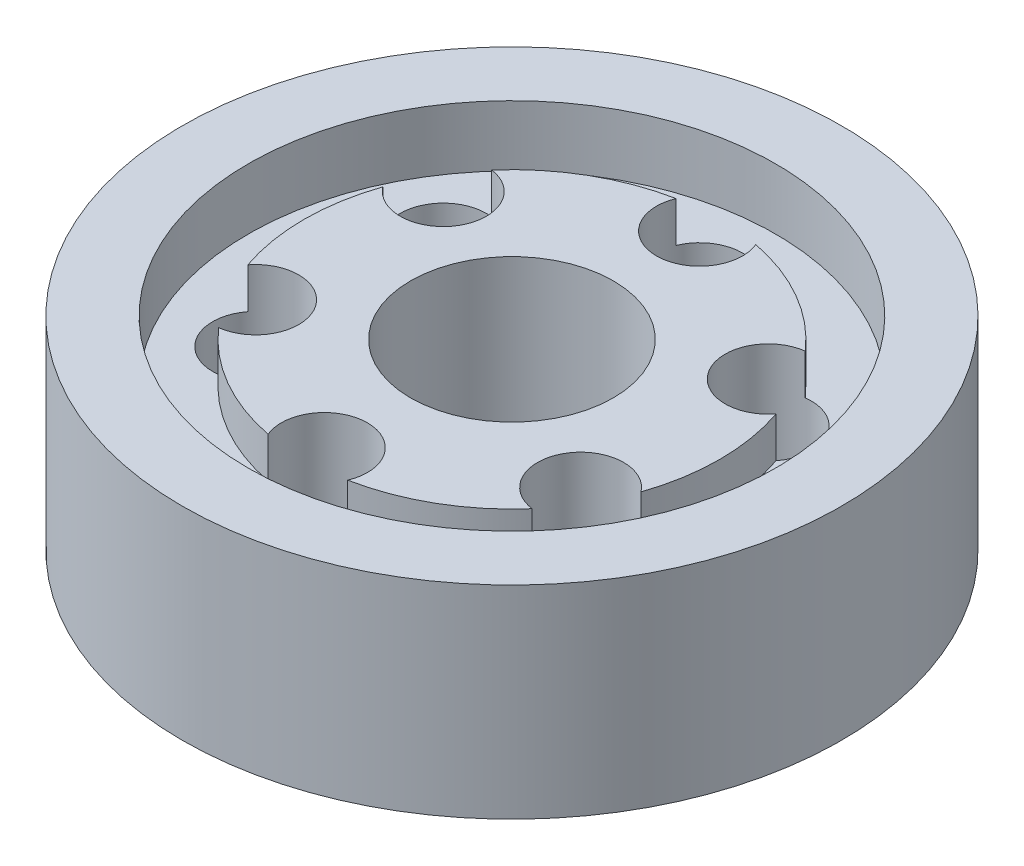
ISO-10303-21;
HEADER;
FILE_DESCRIPTION(('STEP AP214'),'2;1');
FILE_NAME('part.step','',(''),(''),'','','');
FILE_SCHEMA(('AUTOMOTIVE_DESIGN { 1 0 10303 214 1 1 1 1 }'));
ENDSEC;
DATA;
#1=APPLICATION_CONTEXT('core data for automotive mechanical design processes');
#2=APPLICATION_PROTOCOL_DEFINITION('international standard','automotive_design',2000,#1);
#3=PRODUCT_CONTEXT('',#1,'mechanical');
#4=PRODUCT('Part','Part','',(#3));
#5=PRODUCT_RELATED_PRODUCT_CATEGORY('part','',(#4));
#6=PRODUCT_DEFINITION_FORMATION('','',#4);
#7=PRODUCT_DEFINITION_CONTEXT('part definition',#1,'design');
#8=PRODUCT_DEFINITION('design','',#6,#7);
#9=PRODUCT_DEFINITION_SHAPE('','',#8);
#10=(LENGTH_UNIT() NAMED_UNIT(*) SI_UNIT(.MILLI.,.METRE.));
#11=(NAMED_UNIT(*) PLANE_ANGLE_UNIT() SI_UNIT($,.RADIAN.));
#12=(NAMED_UNIT(*) SI_UNIT($,.STERADIAN.) SOLID_ANGLE_UNIT());
#13=UNCERTAINTY_MEASURE_WITH_UNIT(LENGTH_MEASURE(1.E-05),#10,'distance_accuracy_value','');
#14=(GEOMETRIC_REPRESENTATION_CONTEXT(3) GLOBAL_UNCERTAINTY_ASSIGNED_CONTEXT((#13)) GLOBAL_UNIT_ASSIGNED_CONTEXT((#10,
#11,#12)) REPRESENTATION_CONTEXT('',''));
#15=CARTESIAN_POINT('',(0.,0.,0.));
#16=DIRECTION('',(0.,0.,1.));
#17=DIRECTION('',(1.,0.,0.));
#18=AXIS2_PLACEMENT_3D('',#15,#16,#17);
#19=CARTESIAN_POINT('',(0.,18.,0.));
#20=DIRECTION('',(0.,-1.,0.));
#21=DIRECTION('',(0.,0.,-1.));
#22=AXIS2_PLACEMENT_3D('',#19,#20,#21);
#23=CYLINDRICAL_SURFACE('',#22,20.5);
#24=CARTESIAN_POINT('',(0.,14.,0.));
#25=DIRECTION('',(0.,1.,0.));
#26=DIRECTION('',(0.,0.,1.));
#27=AXIS2_PLACEMENT_3D('',#24,#25,#26);
#28=CIRCLE('',#27,20.5);
#29=CARTESIAN_POINT('',(-19.3889539201822,14.,-6.65721156949742));
#30=VERTEX_POINT('',#29);
#31=CARTESIAN_POINT('',(-19.3889539201821,14.,6.65721156949784));
#32=VERTEX_POINT('',#31);
#33=EDGE_CURVE('E289',#30,#32,#28,.T.);
#34=ORIENTED_EDGE('',*,*,#33,.T.);
#35=DIRECTION('',(0.,-1.,0.));
#36=VECTOR('',#35,1.);
#37=CARTESIAN_POINT('',(-19.3889539201821,17.25,6.65721156949784));
#38=LINE('',#37,#36);
#39=CARTESIAN_POINT('',(-19.3889539201821,18.,6.65721156949784));
#40=VERTEX_POINT('',#39);
#41=EDGE_CURVE('E11',#32,#40,#38,.F.);
#42=ORIENTED_EDGE('',*,*,#41,.T.);
#43=CARTESIAN_POINT('',(0.,18.,0.));
#44=DIRECTION('',(0.,1.,0.));
#45=DIRECTION('',(0.,0.,1.));
#46=AXIS2_PLACEMENT_3D('',#43,#44,#45);
#47=CIRCLE('',#46,20.5);
#48=CARTESIAN_POINT('',(-19.3889539201822,18.,-6.65721156949742));
#49=VERTEX_POINT('',#48);
#50=EDGE_CURVE('E137',#49,#40,#47,.T.);
#51=ORIENTED_EDGE('',*,*,#50,.F.);
#52=DIRECTION('',(0.,-1.,0.));
#53=VECTOR('',#52,1.);
#54=CARTESIAN_POINT('',(-19.3889539201822,17.25,-6.65721156949743));
#55=LINE('',#54,#53);
#56=EDGE_CURVE('E180',#49,#30,#55,.T.);
#57=ORIENTED_EDGE('',*,*,#56,.T.);
#58=EDGE_LOOP('',(#34,#42,#51,#57));
#59=FACE_BOUND('',#58,.T.);
#60=ADVANCED_FACE('F35',(#59),#23,.T.);
#61=CARTESIAN_POINT('',(-3.92916262253849,14.,-20.1199324324324));
#62=VERTEX_POINT('',#61);
#63=CARTESIAN_POINT('',(-15.4597912976438,14.,-13.4627208629347));
#64=VERTEX_POINT('',#63);
#65=EDGE_CURVE('E179',#62,#64,#28,.T.);
#66=ORIENTED_EDGE('',*,*,#65,.T.);
#67=DIRECTION('',(0.,-1.,0.));
#68=VECTOR('',#67,1.);
#69=CARTESIAN_POINT('',(-15.4597912976438,17.25,-13.4627208629347));
#70=LINE('',#69,#68);
#71=CARTESIAN_POINT('',(-15.4597912976438,18.,-13.4627208629347));
#72=VERTEX_POINT('',#71);
#73=EDGE_CURVE('E127',#64,#72,#70,.F.);
#74=ORIENTED_EDGE('',*,*,#73,.T.);
#75=CARTESIAN_POINT('',(-3.92916262253849,18.,-20.1199324324324));
#76=VERTEX_POINT('',#75);
#77=EDGE_CURVE('E147',#76,#72,#47,.T.);
#78=ORIENTED_EDGE('',*,*,#77,.F.);
#79=DIRECTION('',(0.,-1.,0.));
#80=VECTOR('',#79,1.);
#81=CARTESIAN_POINT('',(-3.92916262253848,17.25,-20.1199324324324));
#82=LINE('',#81,#80);
#83=EDGE_CURVE('E177',#76,#62,#82,.T.);
#84=ORIENTED_EDGE('',*,*,#83,.T.);
#85=EDGE_LOOP('',(#66,#74,#78,#84));
#86=FACE_BOUND('',#85,.T.);
#87=ADVANCED_FACE('F176',(#86),#23,.T.);
#88=CARTESIAN_POINT('',(15.4597912976436,14.,-13.4627208629349));
#89=VERTEX_POINT('',#88);
#90=CARTESIAN_POINT('',(3.92916262253847,14.,-20.1199324324324));
#91=VERTEX_POINT('',#90);
#92=EDGE_CURVE('E291',#89,#91,#28,.T.);
#93=ORIENTED_EDGE('',*,*,#92,.T.);
#94=DIRECTION('',(0.,-1.,0.));
#95=VECTOR('',#94,1.);
#96=CARTESIAN_POINT('',(3.92916262253848,17.25,-20.1199324324324));
#97=LINE('',#96,#95);
#98=CARTESIAN_POINT('',(3.92916262253847,18.,-20.1199324324324));
#99=VERTEX_POINT('',#98);
#100=EDGE_CURVE('E182',#91,#99,#97,.F.);
#101=ORIENTED_EDGE('',*,*,#100,.T.);
#102=CARTESIAN_POINT('',(15.4597912976436,18.,-13.4627208629349));
#103=VERTEX_POINT('',#102);
#104=EDGE_CURVE('E162',#103,#99,#47,.T.);
#105=ORIENTED_EDGE('',*,*,#104,.F.);
#106=DIRECTION('',(0.,-1.,0.));
#107=VECTOR('',#106,1.);
#108=CARTESIAN_POINT('',(15.4597912976436,17.25,-13.4627208629349));
#109=LINE('',#108,#107);
#110=EDGE_CURVE('E191',#103,#89,#109,.T.);
#111=ORIENTED_EDGE('',*,*,#110,.T.);
#112=EDGE_LOOP('',(#93,#101,#105,#111));
#113=FACE_BOUND('',#112,.T.);
#114=ADVANCED_FACE('F249',(#113),#23,.T.);
#115=CARTESIAN_POINT('',(19.3889539201822,14.,6.65721156949756));
#116=VERTEX_POINT('',#115);
#117=CARTESIAN_POINT('',(19.3889539201821,14.,-6.65721156949769));
#118=VERTEX_POINT('',#117);
#119=EDGE_CURVE('E149',#116,#118,#28,.T.);
#120=ORIENTED_EDGE('',*,*,#119,.T.);
#121=DIRECTION('',(0.,-1.,0.));
#122=VECTOR('',#121,1.);
#123=CARTESIAN_POINT('',(19.3889539201821,17.25,-6.65721156949769));
#124=LINE('',#123,#122);
#125=CARTESIAN_POINT('',(19.3889539201821,18.,-6.65721156949769));
#126=VERTEX_POINT('',#125);
#127=EDGE_CURVE('E188',#118,#126,#124,.F.);
#128=ORIENTED_EDGE('',*,*,#127,.T.);
#129=CARTESIAN_POINT('',(19.3889539201822,18.,6.65721156949756));
#130=VERTEX_POINT('',#129);
#131=EDGE_CURVE('E155',#130,#126,#47,.T.);
#132=ORIENTED_EDGE('',*,*,#131,.F.);
#133=DIRECTION('',(0.,-1.,0.));
#134=VECTOR('',#133,1.);
#135=CARTESIAN_POINT('',(19.3889539201822,17.25,6.65721156949756));
#136=LINE('',#135,#134);
#137=EDGE_CURVE('E197',#130,#116,#136,.T.);
#138=ORIENTED_EDGE('',*,*,#137,.T.);
#139=EDGE_LOOP('',(#120,#128,#132,#138));
#140=FACE_BOUND('',#139,.T.);
#141=ADVANCED_FACE('F260',(#140),#23,.T.);
#142=CARTESIAN_POINT('',(3.92916262253848,14.,20.1199324324324));
#143=VERTEX_POINT('',#142);
#144=CARTESIAN_POINT('',(15.4597912976437,14.,13.4627208629348));
#145=VERTEX_POINT('',#144);
#146=EDGE_CURVE('E144',#143,#145,#28,.T.);
#147=ORIENTED_EDGE('',*,*,#146,.T.);
#148=DIRECTION('',(0.,-1.,0.));
#149=VECTOR('',#148,1.);
#150=CARTESIAN_POINT('',(15.4597912976437,17.25,13.4627208629348));
#151=LINE('',#150,#149);
#152=CARTESIAN_POINT('',(15.4597912976437,18.,13.4627208629348));
#153=VERTEX_POINT('',#152);
#154=EDGE_CURVE('E194',#145,#153,#151,.F.);
#155=ORIENTED_EDGE('',*,*,#154,.T.);
#156=CARTESIAN_POINT('',(3.92916262253848,18.,20.1199324324324));
#157=VERTEX_POINT('',#156);
#158=EDGE_CURVE('E146',#157,#153,#47,.T.);
#159=ORIENTED_EDGE('',*,*,#158,.F.);
#160=DIRECTION('',(0.,-1.,0.));
#161=VECTOR('',#160,1.);
#162=CARTESIAN_POINT('',(3.92916262253848,17.25,20.1199324324324));
#163=LINE('',#162,#161);
#164=EDGE_CURVE('E206',#157,#143,#163,.T.);
#165=ORIENTED_EDGE('',*,*,#164,.T.);
#166=EDGE_LOOP('',(#147,#155,#159,#165));
#167=FACE_BOUND('',#166,.T.);
#168=ADVANCED_FACE('F254',(#167),#23,.T.);
#169=CARTESIAN_POINT('',(0.,14.,0.));
#170=DIRECTION('',(0.,1.,0.));
#171=DIRECTION('',(0.,0.,1.));
#172=AXIS2_PLACEMENT_3D('',#169,#170,#171);
#173=PLANE('',#172);
#174=CARTESIAN_POINT('',(-16.021469970012,14.,9.25000000000019));
#175=DIRECTION('',(0.,1.,0.));
#176=DIRECTION('',(0.,0.,1.));
#177=AXIS2_PLACEMENT_3D('',#174,#175,#176);
#178=CIRCLE('',#177,4.24999999999999);
#179=CARTESIAN_POINT('',(-15.4597912976435,14.,13.462720862935));
#180=VERTEX_POINT('',#179);
#181=EDGE_CURVE('E50',#32,#180,#178,.T.);
#182=ORIENTED_EDGE('',*,*,#181,.F.);
#183=ORIENTED_EDGE('',*,*,#33,.F.);
#184=CARTESIAN_POINT('',(-16.0214699700122,14.,-9.24999999999985));
#185=DIRECTION('',(0.,1.,0.));
#186=DIRECTION('',(0.,0.,1.));
#187=AXIS2_PLACEMENT_3D('',#184,#185,#186);
#188=CIRCLE('',#187,4.24999999999999);
#189=EDGE_CURVE('E58',#64,#30,#188,.T.);
#190=ORIENTED_EDGE('',*,*,#189,.F.);
#191=ORIENTED_EDGE('',*,*,#65,.F.);
#192=CARTESIAN_POINT('',(0.,14.,-18.5));
#193=DIRECTION('',(0.,1.,0.));
#194=DIRECTION('',(0.,0.,1.));
#195=AXIS2_PLACEMENT_3D('',#192,#193,#194);
#196=CIRCLE('',#195,4.24999999999999);
#197=EDGE_CURVE('E312',#91,#62,#196,.T.);
#198=ORIENTED_EDGE('',*,*,#197,.F.);
#199=ORIENTED_EDGE('',*,*,#92,.F.);
#200=CARTESIAN_POINT('',(16.0214699700121,14.,-9.25000000000008));
#201=DIRECTION('',(0.,1.,0.));
#202=DIRECTION('',(0.,0.,1.));
#203=AXIS2_PLACEMENT_3D('',#200,#201,#202);
#204=CIRCLE('',#203,4.24999999999999);
#205=EDGE_CURVE('E304',#118,#89,#204,.T.);
#206=ORIENTED_EDGE('',*,*,#205,.F.);
#207=ORIENTED_EDGE('',*,*,#119,.F.);
#208=CARTESIAN_POINT('',(16.0214699700121,14.,9.24999999999996));
#209=DIRECTION('',(0.,1.,0.));
#210=DIRECTION('',(0.,0.,1.));
#211=AXIS2_PLACEMENT_3D('',#208,#209,#210);
#212=CIRCLE('',#211,4.24999999999999);
#213=EDGE_CURVE('E273',#145,#116,#212,.T.);
#214=ORIENTED_EDGE('',*,*,#213,.F.);
#215=ORIENTED_EDGE('',*,*,#146,.F.);
#216=CARTESIAN_POINT('',(0.,14.,18.5));
#217=DIRECTION('',(0.,1.,0.));
#218=DIRECTION('',(0.,0.,1.));
#219=AXIS2_PLACEMENT_3D('',#216,#217,#218);
#220=CIRCLE('',#219,4.24999999999999);
#221=CARTESIAN_POINT('',(-3.92916262253847,14.,20.1199324324324));
#222=VERTEX_POINT('',#221);
#223=EDGE_CURVE('E271',#222,#143,#220,.T.);
#224=ORIENTED_EDGE('',*,*,#223,.F.);
#225=EDGE_CURVE('E151',#180,#222,#28,.T.);
#226=ORIENTED_EDGE('',*,*,#225,.F.);
#227=EDGE_LOOP('',(#182,#183,#190,#191,#198,#199,#206,#207,#214,#215,#224,#226));
#228=FACE_BOUND('',#227,.T.);
#229=CARTESIAN_POINT('',(0.,14.,0.));
#230=DIRECTION('',(0.,1.,0.));
#231=DIRECTION('',(0.,0.,1.));
#232=AXIS2_PLACEMENT_3D('',#229,#230,#231);
#233=CIRCLE('',#232,26.);
#234=CARTESIAN_POINT('',(0.,14.,26.));
#235=VERTEX_POINT('',#234);
#236=EDGE_CURVE('E159',#235,#235,#233,.T.);
#237=ORIENTED_EDGE('',*,*,#236,.T.);
#238=EDGE_LOOP('',(#237));
#239=FACE_BOUND('',#238,.T.);
#240=ADVANCED_FACE('F218',(#228,#239),#173,.T.);
#241=CARTESIAN_POINT('',(0.,20.,0.));
#242=DIRECTION('',(0.,-1.,0.));
#243=DIRECTION('',(0.,0.,-1.));
#244=AXIS2_PLACEMENT_3D('',#241,#242,#243);
#245=CYLINDRICAL_SURFACE('',#244,32.5);
#246=CARTESIAN_POINT('',(0.,20.,0.));
#247=DIRECTION('',(0.,1.,0.));
#248=DIRECTION('',(0.,0.,1.));
#249=AXIS2_PLACEMENT_3D('',#246,#247,#248);
#250=CIRCLE('',#249,32.5);
#251=CARTESIAN_POINT('',(0.,20.,32.5));
#252=VERTEX_POINT('',#251);
#253=EDGE_CURVE('E209',#252,#252,#250,.T.);
#254=ORIENTED_EDGE('',*,*,#253,.F.);
#255=EDGE_LOOP('',(#254));
#256=FACE_BOUND('',#255,.T.);
#257=CARTESIAN_POINT('',(0.,0.,0.));
#258=DIRECTION('',(0.,1.,0.));
#259=DIRECTION('',(0.,0.,1.));
#260=AXIS2_PLACEMENT_3D('',#257,#258,#259);
#261=CIRCLE('',#260,32.5);
#262=CARTESIAN_POINT('',(0.,0.,32.5));
#263=VERTEX_POINT('',#262);
#264=EDGE_CURVE('E210',#263,#263,#261,.T.);
#265=ORIENTED_EDGE('',*,*,#264,.T.);
#266=EDGE_LOOP('',(#265));
#267=FACE_BOUND('',#266,.T.);
#268=ADVANCED_FACE('F37',(#256,#267),#245,.T.);
#269=CARTESIAN_POINT('',(0.,20.,0.));
#270=DIRECTION('',(0.,1.,0.));
#271=DIRECTION('',(0.,0.,1.));
#272=AXIS2_PLACEMENT_3D('',#269,#270,#271);
#273=PLANE('',#272);
#274=CARTESIAN_POINT('',(0.,20.,0.));
#275=DIRECTION('',(0.,1.,0.));
#276=DIRECTION('',(0.,0.,1.));
#277=AXIS2_PLACEMENT_3D('',#274,#275,#276);
#278=CIRCLE('',#277,26.);
#279=CARTESIAN_POINT('',(0.,20.,26.));
#280=VERTEX_POINT('',#279);
#281=EDGE_CURVE('E154',#280,#280,#278,.T.);
#282=ORIENTED_EDGE('',*,*,#281,.F.);
#283=EDGE_LOOP('',(#282));
#284=FACE_BOUND('',#283,.T.);
#285=ORIENTED_EDGE('',*,*,#253,.T.);
#286=EDGE_LOOP('',(#285));
#287=FACE_BOUND('',#286,.T.);
#288=ADVANCED_FACE('F227',(#284,#287),#273,.T.);
#289=CARTESIAN_POINT('',(0.,0.,0.));
#290=DIRECTION('',(0.,1.,0.));
#291=DIRECTION('',(0.,0.,1.));
#292=AXIS2_PLACEMENT_3D('',#289,#290,#291);
#293=PLANE('',#292);
#294=CARTESIAN_POINT('',(-16.021469970012,0.,9.25000000000019));
#295=DIRECTION('',(0.,-1.,0.));
#296=DIRECTION('',(0.,0.,-1.));
#297=AXIS2_PLACEMENT_3D('',#294,#295,#296);
#298=CIRCLE('',#297,4.24999999999999);
#299=CARTESIAN_POINT('',(-16.021469970012,0.,5.0000000000002));
#300=VERTEX_POINT('',#299);
#301=EDGE_CURVE('E138',#300,#300,#298,.T.);
#302=ORIENTED_EDGE('',*,*,#301,.F.);
#303=EDGE_LOOP('',(#302));
#304=FACE_BOUND('',#303,.T.);
#305=CARTESIAN_POINT('',(-16.0214699700122,0.,-9.24999999999985));
#306=DIRECTION('',(0.,-1.,0.));
#307=DIRECTION('',(0.,0.,-1.));
#308=AXIS2_PLACEMENT_3D('',#305,#306,#307);
#309=CIRCLE('',#308,4.24999999999999);
#310=CARTESIAN_POINT('',(-16.0214699700122,0.,-13.4999999999998));
#311=VERTEX_POINT('',#310);
#312=EDGE_CURVE('E320',#311,#311,#309,.T.);
#313=ORIENTED_EDGE('',*,*,#312,.F.);
#314=EDGE_LOOP('',(#313));
#315=FACE_BOUND('',#314,.T.);
#316=CARTESIAN_POINT('',(0.,0.,-18.5));
#317=DIRECTION('',(0.,-1.,0.));
#318=DIRECTION('',(0.,0.,-1.));
#319=AXIS2_PLACEMENT_3D('',#316,#317,#318);
#320=CIRCLE('',#319,4.24999999999999);
#321=CARTESIAN_POINT('',(0.,0.,-22.75));
#322=VERTEX_POINT('',#321);
#323=EDGE_CURVE('E315',#322,#322,#320,.T.);
#324=ORIENTED_EDGE('',*,*,#323,.F.);
#325=EDGE_LOOP('',(#324));
#326=FACE_BOUND('',#325,.T.);
#327=CARTESIAN_POINT('',(16.0214699700121,0.,-9.25000000000008));
#328=DIRECTION('',(0.,-1.,0.));
#329=DIRECTION('',(0.,0.,-1.));
#330=AXIS2_PLACEMENT_3D('',#327,#328,#329);
#331=CIRCLE('',#330,4.24999999999999);
#332=CARTESIAN_POINT('',(16.0214699700121,0.,-13.5000000000001));
#333=VERTEX_POINT('',#332);
#334=EDGE_CURVE('E309',#333,#333,#331,.T.);
#335=ORIENTED_EDGE('',*,*,#334,.F.);
#336=EDGE_LOOP('',(#335));
#337=FACE_BOUND('',#336,.T.);
#338=CARTESIAN_POINT('',(16.0214699700121,0.,9.24999999999996));
#339=DIRECTION('',(0.,-1.,0.));
#340=DIRECTION('',(0.,0.,-1.));
#341=AXIS2_PLACEMENT_3D('',#338,#339,#340);
#342=CIRCLE('',#341,4.24999999999999);
#343=CARTESIAN_POINT('',(16.0214699700121,0.,4.99999999999998));
#344=VERTEX_POINT('',#343);
#345=EDGE_CURVE('E281',#344,#344,#342,.T.);
#346=ORIENTED_EDGE('',*,*,#345,.F.);
#347=EDGE_LOOP('',(#346));
#348=FACE_BOUND('',#347,.T.);
#349=CARTESIAN_POINT('',(0.,0.,0.));
#350=DIRECTION('',(0.,-1.,0.));
#351=DIRECTION('',(0.,0.,-1.));
#352=AXIS2_PLACEMENT_3D('',#349,#350,#351);
#353=CIRCLE('',#352,10.);
#354=CARTESIAN_POINT('',(0.,0.,-10.));
#355=VERTEX_POINT('',#354);
#356=EDGE_CURVE('E204',#355,#355,#353,.T.);
#357=ORIENTED_EDGE('',*,*,#356,.F.);
#358=EDGE_LOOP('',(#357));
#359=FACE_BOUND('',#358,.T.);
#360=CARTESIAN_POINT('',(0.,0.,18.5));
#361=DIRECTION('',(0.,-1.,0.));
#362=DIRECTION('',(0.,0.,-1.));
#363=AXIS2_PLACEMENT_3D('',#360,#361,#362);
#364=CIRCLE('',#363,4.24999999999999);
#365=CARTESIAN_POINT('',(0.,0.,14.25));
#366=VERTEX_POINT('',#365);
#367=EDGE_CURVE('E203',#366,#366,#364,.T.);
#368=ORIENTED_EDGE('',*,*,#367,.F.);
#369=EDGE_LOOP('',(#368));
#370=FACE_BOUND('',#369,.T.);
#371=ORIENTED_EDGE('',*,*,#264,.F.);
#372=EDGE_LOOP('',(#371));
#373=FACE_BOUND('',#372,.T.);
#374=ADVANCED_FACE('F223',(#304,#315,#326,#337,#348,#359,#370,#373),#293,.F.);
#375=CARTESIAN_POINT('',(0.,14.,0.));
#376=DIRECTION('',(0.,1.,0.));
#377=DIRECTION('',(0.,0.,1.));
#378=AXIS2_PLACEMENT_3D('',#375,#376,#377);
#379=CYLINDRICAL_SURFACE('',#378,26.);
#380=ORIENTED_EDGE('',*,*,#236,.F.);
#381=EDGE_LOOP('',(#380));
#382=FACE_BOUND('',#381,.T.);
#383=ORIENTED_EDGE('',*,*,#281,.T.);
#384=EDGE_LOOP('',(#383));
#385=FACE_BOUND('',#384,.T.);
#386=ADVANCED_FACE('F220',(#382,#385),#379,.F.);
#387=CARTESIAN_POINT('',(-15.4597912976435,18.,13.462720862935));
#388=VERTEX_POINT('',#387);
#389=CARTESIAN_POINT('',(-3.92916262253847,18.,20.1199324324324));
#390=VERTEX_POINT('',#389);
#391=EDGE_CURVE('E133',#388,#390,#47,.T.);
#392=ORIENTED_EDGE('',*,*,#391,.F.);
#393=DIRECTION('',(0.,-1.,0.));
#394=VECTOR('',#393,1.);
#395=CARTESIAN_POINT('',(-15.4597912976435,17.25,13.462720862935));
#396=LINE('',#395,#394);
#397=EDGE_CURVE('E43',#388,#180,#396,.T.);
#398=ORIENTED_EDGE('',*,*,#397,.T.);
#399=ORIENTED_EDGE('',*,*,#225,.T.);
#400=DIRECTION('',(0.,-1.,0.));
#401=VECTOR('',#400,1.);
#402=CARTESIAN_POINT('',(-3.92916262253848,17.25,20.1199324324324));
#403=LINE('',#402,#401);
#404=EDGE_CURVE('E143',#222,#390,#403,.F.);
#405=ORIENTED_EDGE('',*,*,#404,.T.);
#406=EDGE_LOOP('',(#392,#398,#399,#405));
#407=FACE_BOUND('',#406,.T.);
#408=ADVANCED_FACE('F141',(#407),#23,.T.);
#409=CARTESIAN_POINT('',(0.,18.,0.));
#410=DIRECTION('',(0.,1.,0.));
#411=DIRECTION('',(0.,0.,1.));
#412=AXIS2_PLACEMENT_3D('',#409,#410,#411);
#413=PLANE('',#412);
#414=CARTESIAN_POINT('',(-16.021469970012,18.,9.25000000000019));
#415=DIRECTION('',(0.,1.,0.));
#416=DIRECTION('',(0.,0.,1.));
#417=AXIS2_PLACEMENT_3D('',#414,#415,#416);
#418=CIRCLE('',#417,4.24999999999999);
#419=EDGE_CURVE('E123',#388,#40,#418,.T.);
#420=ORIENTED_EDGE('',*,*,#419,.F.);
#421=ORIENTED_EDGE('',*,*,#391,.T.);
#422=CARTESIAN_POINT('',(0.,18.,18.5));
#423=DIRECTION('',(0.,1.,0.));
#424=DIRECTION('',(0.,0.,1.));
#425=AXIS2_PLACEMENT_3D('',#422,#423,#424);
#426=CIRCLE('',#425,4.24999999999999);
#427=EDGE_CURVE('E287',#157,#390,#426,.T.);
#428=ORIENTED_EDGE('',*,*,#427,.F.);
#429=ORIENTED_EDGE('',*,*,#158,.T.);
#430=CARTESIAN_POINT('',(16.0214699700121,18.,9.24999999999996));
#431=DIRECTION('',(0.,1.,0.));
#432=DIRECTION('',(0.,0.,1.));
#433=AXIS2_PLACEMENT_3D('',#430,#431,#432);
#434=CIRCLE('',#433,4.24999999999999);
#435=EDGE_CURVE('E277',#130,#153,#434,.T.);
#436=ORIENTED_EDGE('',*,*,#435,.F.);
#437=ORIENTED_EDGE('',*,*,#131,.T.);
#438=CARTESIAN_POINT('',(16.0214699700121,18.,-9.25000000000008));
#439=DIRECTION('',(0.,1.,0.));
#440=DIRECTION('',(0.,0.,1.));
#441=AXIS2_PLACEMENT_3D('',#438,#439,#440);
#442=CIRCLE('',#441,4.24999999999999);
#443=EDGE_CURVE('E305',#103,#126,#442,.T.);
#444=ORIENTED_EDGE('',*,*,#443,.F.);
#445=ORIENTED_EDGE('',*,*,#104,.T.);
#446=CARTESIAN_POINT('',(0.,18.,-18.5));
#447=DIRECTION('',(0.,1.,0.));
#448=DIRECTION('',(0.,0.,1.));
#449=AXIS2_PLACEMENT_3D('',#446,#447,#448);
#450=CIRCLE('',#449,4.24999999999999);
#451=EDGE_CURVE('E171',#76,#99,#450,.T.);
#452=ORIENTED_EDGE('',*,*,#451,.F.);
#453=ORIENTED_EDGE('',*,*,#77,.T.);
#454=CARTESIAN_POINT('',(-16.0214699700122,18.,-9.24999999999985));
#455=DIRECTION('',(0.,1.,0.));
#456=DIRECTION('',(0.,0.,1.));
#457=AXIS2_PLACEMENT_3D('',#454,#455,#456);
#458=CIRCLE('',#457,4.24999999999999);
#459=EDGE_CURVE('E170',#49,#72,#458,.T.);
#460=ORIENTED_EDGE('',*,*,#459,.F.);
#461=ORIENTED_EDGE('',*,*,#50,.T.);
#462=EDGE_LOOP('',(#420,#421,#428,#429,#436,#437,#444,#445,#452,#453,#460,#461));
#463=FACE_BOUND('',#462,.T.);
#464=CARTESIAN_POINT('',(0.,18.,0.));
#465=DIRECTION('',(0.,1.,0.));
#466=DIRECTION('',(0.,0.,1.));
#467=AXIS2_PLACEMENT_3D('',#464,#465,#466);
#468=CIRCLE('',#467,10.);
#469=CARTESIAN_POINT('',(0.,18.,10.));
#470=VERTEX_POINT('',#469);
#471=EDGE_CURVE('E200',#470,#470,#468,.T.);
#472=ORIENTED_EDGE('',*,*,#471,.F.);
#473=EDGE_LOOP('',(#472));
#474=FACE_BOUND('',#473,.T.);
#475=ADVANCED_FACE('F130',(#463,#474),#413,.T.);
#476=CARTESIAN_POINT('',(0.,0.,18.5));
#477=DIRECTION('',(0.,-1.,0.));
#478=DIRECTION('',(0.,0.,-1.));
#479=AXIS2_PLACEMENT_3D('',#476,#477,#478);
#480=CYLINDRICAL_SURFACE('',#479,4.24999999999999);
#481=ORIENTED_EDGE('',*,*,#223,.T.);
#482=ORIENTED_EDGE('',*,*,#164,.F.);
#483=ORIENTED_EDGE('',*,*,#427,.T.);
#484=ORIENTED_EDGE('',*,*,#404,.F.);
#485=EDGE_LOOP('',(#481,#482,#483,#484));
#486=FACE_BOUND('',#485,.T.);
#487=ORIENTED_EDGE('',*,*,#367,.T.);
#488=EDGE_LOOP('',(#487));
#489=FACE_BOUND('',#488,.T.);
#490=ADVANCED_FACE('F258',(#486,#489),#480,.F.);
#491=CARTESIAN_POINT('',(0.,20.,0.));
#492=DIRECTION('',(0.,-1.,0.));
#493=DIRECTION('',(0.,0.,-1.));
#494=AXIS2_PLACEMENT_3D('',#491,#492,#493);
#495=CYLINDRICAL_SURFACE('',#494,10.);
#496=ORIENTED_EDGE('',*,*,#471,.T.);
#497=EDGE_LOOP('',(#496));
#498=FACE_BOUND('',#497,.T.);
#499=ORIENTED_EDGE('',*,*,#356,.T.);
#500=EDGE_LOOP('',(#499));
#501=FACE_BOUND('',#500,.T.);
#502=ADVANCED_FACE('F299',(#498,#501),#495,.F.);
#503=CARTESIAN_POINT('',(16.0214699700121,0.,9.24999999999996));
#504=DIRECTION('',(0.,-1.,0.));
#505=DIRECTION('',(0.,0.,-1.));
#506=AXIS2_PLACEMENT_3D('',#503,#504,#505);
#507=CYLINDRICAL_SURFACE('',#506,4.24999999999999);
#508=ORIENTED_EDGE('',*,*,#213,.T.);
#509=ORIENTED_EDGE('',*,*,#137,.F.);
#510=ORIENTED_EDGE('',*,*,#435,.T.);
#511=ORIENTED_EDGE('',*,*,#154,.F.);
#512=EDGE_LOOP('',(#508,#509,#510,#511));
#513=FACE_BOUND('',#512,.T.);
#514=ORIENTED_EDGE('',*,*,#345,.T.);
#515=EDGE_LOOP('',(#514));
#516=FACE_BOUND('',#515,.T.);
#517=ADVANCED_FACE('F295',(#513,#516),#507,.F.);
#518=CARTESIAN_POINT('',(16.0214699700121,0.,-9.25000000000008));
#519=DIRECTION('',(0.,-1.,0.));
#520=DIRECTION('',(0.,0.,-1.));
#521=AXIS2_PLACEMENT_3D('',#518,#519,#520);
#522=CYLINDRICAL_SURFACE('',#521,4.24999999999999);
#523=ORIENTED_EDGE('',*,*,#205,.T.);
#524=ORIENTED_EDGE('',*,*,#110,.F.);
#525=ORIENTED_EDGE('',*,*,#443,.T.);
#526=ORIENTED_EDGE('',*,*,#127,.F.);
#527=EDGE_LOOP('',(#523,#524,#525,#526));
#528=FACE_BOUND('',#527,.T.);
#529=ORIENTED_EDGE('',*,*,#334,.T.);
#530=EDGE_LOOP('',(#529));
#531=FACE_BOUND('',#530,.T.);
#532=ADVANCED_FACE('F298',(#528,#531),#522,.F.);
#533=CARTESIAN_POINT('',(0.,0.,-18.5));
#534=DIRECTION('',(0.,-1.,0.));
#535=DIRECTION('',(0.,0.,-1.));
#536=AXIS2_PLACEMENT_3D('',#533,#534,#535);
#537=CYLINDRICAL_SURFACE('',#536,4.24999999999999);
#538=ORIENTED_EDGE('',*,*,#323,.T.);
#539=EDGE_LOOP('',(#538));
#540=FACE_BOUND('',#539,.T.);
#541=ORIENTED_EDGE('',*,*,#197,.T.);
#542=ORIENTED_EDGE('',*,*,#83,.F.);
#543=ORIENTED_EDGE('',*,*,#451,.T.);
#544=ORIENTED_EDGE('',*,*,#100,.F.);
#545=EDGE_LOOP('',(#541,#542,#543,#544));
#546=FACE_BOUND('',#545,.T.);
#547=ADVANCED_FACE('F332',(#540,#546),#537,.F.);
#548=CARTESIAN_POINT('',(-16.0214699700122,0.,-9.24999999999985));
#549=DIRECTION('',(0.,-1.,0.));
#550=DIRECTION('',(0.,0.,-1.));
#551=AXIS2_PLACEMENT_3D('',#548,#549,#550);
#552=CYLINDRICAL_SURFACE('',#551,4.24999999999999);
#553=ORIENTED_EDGE('',*,*,#312,.T.);
#554=EDGE_LOOP('',(#553));
#555=FACE_BOUND('',#554,.T.);
#556=ORIENTED_EDGE('',*,*,#189,.T.);
#557=ORIENTED_EDGE('',*,*,#56,.F.);
#558=ORIENTED_EDGE('',*,*,#459,.T.);
#559=ORIENTED_EDGE('',*,*,#73,.F.);
#560=EDGE_LOOP('',(#556,#557,#558,#559));
#561=FACE_BOUND('',#560,.T.);
#562=ADVANCED_FACE('F327',(#555,#561),#552,.F.);
#563=CARTESIAN_POINT('',(-16.021469970012,0.,9.25000000000019));
#564=DIRECTION('',(0.,-1.,0.));
#565=DIRECTION('',(0.,0.,-1.));
#566=AXIS2_PLACEMENT_3D('',#563,#564,#565);
#567=CYLINDRICAL_SURFACE('',#566,4.24999999999999);
#568=ORIENTED_EDGE('',*,*,#301,.T.);
#569=EDGE_LOOP('',(#568));
#570=FACE_BOUND('',#569,.T.);
#571=ORIENTED_EDGE('',*,*,#181,.T.);
#572=ORIENTED_EDGE('',*,*,#397,.F.);
#573=ORIENTED_EDGE('',*,*,#419,.T.);
#574=ORIENTED_EDGE('',*,*,#41,.F.);
#575=EDGE_LOOP('',(#571,#572,#573,#574));
#576=FACE_BOUND('',#575,.T.);
#577=ADVANCED_FACE('F122',(#570,#576),#567,.F.);
#578=CLOSED_SHELL('',(#60,#87,#114,#141,#168,#240,#268,#288,#374,#386,#408,#475,#490,#502,#517,
#532,#547,#562,#577));
#579=MANIFOLD_SOLID_BREP('B2',#578);
#580=ADVANCED_BREP_SHAPE_REPRESENTATION('',(#18,#579),#14);
#581=SHAPE_DEFINITION_REPRESENTATION(#9,#580);
ENDSEC;
END-ISO-10303-21;
